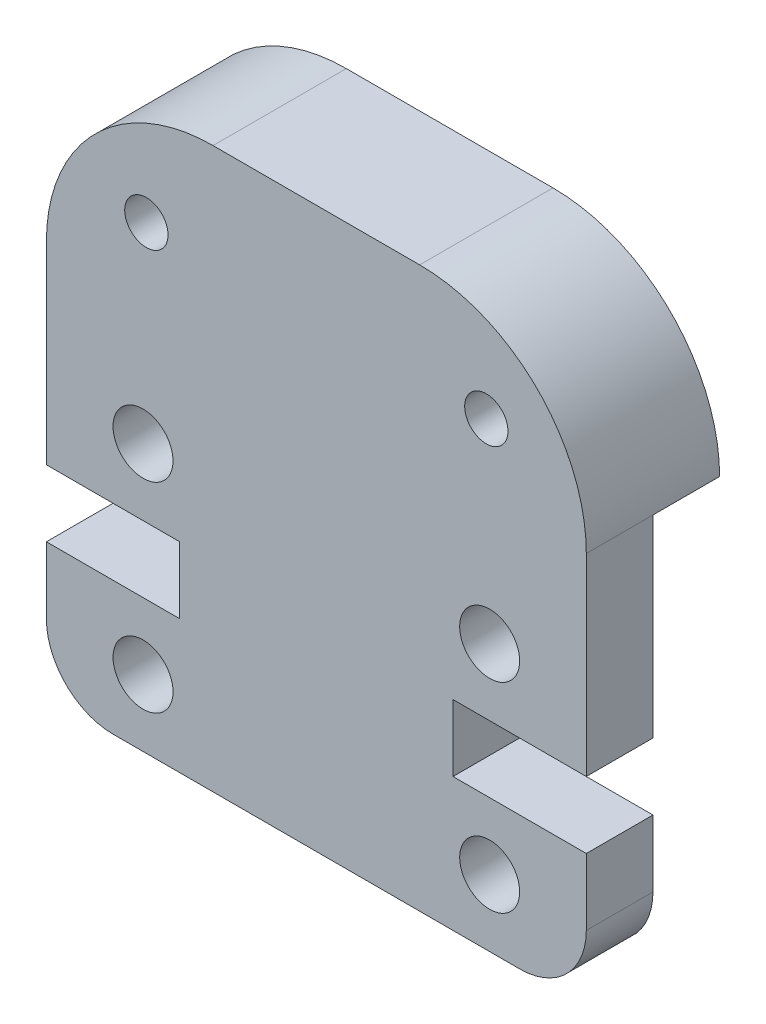
ISO-10303-21;
HEADER;
FILE_DESCRIPTION(('STEP AP214'),'2;1');
FILE_NAME('part.step','',(''),(''),'','','');
FILE_SCHEMA(('AUTOMOTIVE_DESIGN { 1 0 10303 214 1 1 1 1 }'));
ENDSEC;
DATA;
#1=APPLICATION_CONTEXT('core data for automotive mechanical design processes');
#2=APPLICATION_PROTOCOL_DEFINITION('international standard','automotive_design',2000,#1);
#3=PRODUCT_CONTEXT('',#1,'mechanical');
#4=PRODUCT('Part','Part','',(#3));
#5=PRODUCT_RELATED_PRODUCT_CATEGORY('part','',(#4));
#6=PRODUCT_DEFINITION_FORMATION('','',#4);
#7=PRODUCT_DEFINITION_CONTEXT('part definition',#1,'design');
#8=PRODUCT_DEFINITION('design','',#6,#7);
#9=PRODUCT_DEFINITION_SHAPE('','',#8);
#10=(LENGTH_UNIT() NAMED_UNIT(*) SI_UNIT(.MILLI.,.METRE.));
#11=(NAMED_UNIT(*) PLANE_ANGLE_UNIT() SI_UNIT($,.RADIAN.));
#12=(NAMED_UNIT(*) SI_UNIT($,.STERADIAN.) SOLID_ANGLE_UNIT());
#13=UNCERTAINTY_MEASURE_WITH_UNIT(LENGTH_MEASURE(1.E-05),#10,'distance_accuracy_value','');
#14=(GEOMETRIC_REPRESENTATION_CONTEXT(3) GLOBAL_UNCERTAINTY_ASSIGNED_CONTEXT((#13)) GLOBAL_UNIT_ASSIGNED_CONTEXT((#10,
#11,#12)) REPRESENTATION_CONTEXT('',''));
#15=CARTESIAN_POINT('',(0.,0.,0.));
#16=DIRECTION('',(0.,0.,1.));
#17=DIRECTION('',(1.,0.,0.));
#18=AXIS2_PLACEMENT_3D('',#15,#16,#17);
#19=CARTESIAN_POINT('',(5.,11.795,0.));
#20=DIRECTION('',(0.,0.,1.));
#21=DIRECTION('',(1.,0.,0.));
#22=AXIS2_PLACEMENT_3D('',#19,#20,#21);
#23=PLANE('',#22);
#24=CARTESIAN_POINT('',(13.1999999999957,13.7949999999999,0.));
#25=DIRECTION('',(0.,0.,1.));
#26=DIRECTION('',(-1.,0.,0.));
#27=AXIS2_PLACEMENT_3D('',#24,#25,#26);
#28=CIRCLE('',#27,0.649999999999999);
#29=CARTESIAN_POINT('',(12.5499999999957,13.7949999999999,0.));
#30=VERTEX_POINT('',#29);
#31=EDGE_CURVE('E262',#30,#30,#28,.T.);
#32=ORIENTED_EDGE('',*,*,#31,.T.);
#33=EDGE_LOOP('',(#32));
#34=FACE_BOUND('',#33,.T.);
#35=CARTESIAN_POINT('',(3.00000000000434,13.7949999999999,0.));
#36=DIRECTION('',(0.,0.,1.));
#37=DIRECTION('',(1.,0.,0.));
#38=AXIS2_PLACEMENT_3D('',#35,#36,#37);
#39=CIRCLE('',#38,0.65);
#40=CARTESIAN_POINT('',(3.65000000000434,13.7949999999999,0.));
#41=VERTEX_POINT('',#40);
#42=EDGE_CURVE('E266',#41,#41,#39,.T.);
#43=ORIENTED_EDGE('',*,*,#42,.T.);
#44=EDGE_LOOP('',(#43));
#45=FACE_BOUND('',#44,.T.);
#46=DIRECTION('',(-1.,0.,0.));
#47=VECTOR('',#46,1.);
#48=CARTESIAN_POINT('',(0.,11.795,0.));
#49=LINE('',#48,#47);
#50=CARTESIAN_POINT('',(16.2,11.795,0.));
#51=VERTEX_POINT('',#50);
#52=CARTESIAN_POINT('',(0.,11.795,0.));
#53=VERTEX_POINT('',#52);
#54=EDGE_CURVE('E220',#51,#53,#49,.T.);
#55=ORIENTED_EDGE('',*,*,#54,.T.);
#56=CARTESIAN_POINT('',(5.,11.795,0.));
#57=DIRECTION('',(0.,0.,1.));
#58=DIRECTION('',(1.,0.,0.));
#59=AXIS2_PLACEMENT_3D('',#56,#57,#58);
#60=CIRCLE('',#59,5.);
#61=CARTESIAN_POINT('',(5.,16.795,0.));
#62=VERTEX_POINT('',#61);
#63=EDGE_CURVE('E147',#62,#53,#60,.T.);
#64=ORIENTED_EDGE('',*,*,#63,.F.);
#65=DIRECTION('',(-1.,0.,0.));
#66=VECTOR('',#65,1.);
#67=CARTESIAN_POINT('',(5.,16.795,0.));
#68=LINE('',#67,#66);
#69=CARTESIAN_POINT('',(11.2,16.795,0.));
#70=VERTEX_POINT('',#69);
#71=EDGE_CURVE('E72',#70,#62,#68,.T.);
#72=ORIENTED_EDGE('',*,*,#71,.F.);
#73=CARTESIAN_POINT('',(11.2,11.795,0.));
#74=DIRECTION('',(0.,0.,1.));
#75=DIRECTION('',(-1.,0.,0.));
#76=AXIS2_PLACEMENT_3D('',#73,#74,#75);
#77=CIRCLE('',#76,5.);
#78=EDGE_CURVE('E66',#51,#70,#77,.T.);
#79=ORIENTED_EDGE('',*,*,#78,.F.);
#80=EDGE_LOOP('',(#55,#64,#72,#79));
#81=FACE_BOUND('',#80,.T.);
#82=ADVANCED_FACE('F33',(#34,#45,#81),#23,.F.);
#83=CARTESIAN_POINT('',(0.,6.00000000000001,4.));
#84=DIRECTION('',(1.,0.,0.));
#85=DIRECTION('',(0.,0.,-1.));
#86=AXIS2_PLACEMENT_3D('',#83,#84,#85);
#87=PLANE('',#86);
#88=DIRECTION('',(0.,-1.,0.));
#89=VECTOR('',#88,1.);
#90=CARTESIAN_POINT('',(0.,0.,2.));
#91=LINE('',#90,#89);
#92=CARTESIAN_POINT('',(0.,11.795,2.));
#93=VERTEX_POINT('',#92);
#94=CARTESIAN_POINT('',(0.,6.00000000000001,2.));
#95=VERTEX_POINT('',#94);
#96=EDGE_CURVE('E203',#93,#95,#91,.T.);
#97=ORIENTED_EDGE('',*,*,#96,.T.);
#98=DIRECTION('',(0.,0.,-1.));
#99=VECTOR('',#98,1.);
#100=CARTESIAN_POINT('',(0.,6.00000000000001,4.));
#101=LINE('',#100,#99);
#102=CARTESIAN_POINT('',(0.,6.00000000000001,4.));
#103=VERTEX_POINT('',#102);
#104=EDGE_CURVE('E43',#103,#95,#101,.T.);
#105=ORIENTED_EDGE('',*,*,#104,.F.);
#106=DIRECTION('',(0.,-1.,0.));
#107=VECTOR('',#106,1.);
#108=CARTESIAN_POINT('',(0.,6.00000000000001,4.));
#109=LINE('',#108,#107);
#110=CARTESIAN_POINT('',(0.,11.795,4.));
#111=VERTEX_POINT('',#110);
#112=EDGE_CURVE('E80',#111,#103,#109,.T.);
#113=ORIENTED_EDGE('',*,*,#112,.F.);
#114=DIRECTION('',(0.,0.,-1.));
#115=VECTOR('',#114,1.);
#116=CARTESIAN_POINT('',(0.,11.795,4.));
#117=LINE('',#116,#115);
#118=EDGE_CURVE('E11',#111,#93,#117,.T.);
#119=ORIENTED_EDGE('',*,*,#118,.T.);
#120=EDGE_LOOP('',(#97,#105,#113,#119));
#121=FACE_BOUND('',#120,.T.);
#122=ADVANCED_FACE('F201',(#121),#87,.F.);
#123=CARTESIAN_POINT('',(0.,6.00000000000001,4.));
#124=DIRECTION('',(0.,1.,0.));
#125=DIRECTION('',(0.,0.,1.));
#126=AXIS2_PLACEMENT_3D('',#123,#124,#125);
#127=PLANE('',#126);
#128=DIRECTION('',(-1.,0.,0.));
#129=VECTOR('',#128,1.);
#130=CARTESIAN_POINT('',(0.,6.00000000000001,2.));
#131=LINE('',#130,#129);
#132=CARTESIAN_POINT('',(4.,6.00000000000001,2.));
#133=VERTEX_POINT('',#132);
#134=EDGE_CURVE('E195',#133,#95,#131,.T.);
#135=ORIENTED_EDGE('',*,*,#134,.F.);
#136=DIRECTION('',(0.,0.,-1.));
#137=VECTOR('',#136,1.);
#138=CARTESIAN_POINT('',(4.,6.00000000000001,4.));
#139=LINE('',#138,#137);
#140=CARTESIAN_POINT('',(4.,6.00000000000001,4.));
#141=VERTEX_POINT('',#140);
#142=EDGE_CURVE('E184',#141,#133,#139,.T.);
#143=ORIENTED_EDGE('',*,*,#142,.F.);
#144=DIRECTION('',(1.,0.,0.));
#145=VECTOR('',#144,1.);
#146=CARTESIAN_POINT('',(0.,6.00000000000001,4.));
#147=LINE('',#146,#145);
#148=EDGE_CURVE('E196',#103,#141,#147,.T.);
#149=ORIENTED_EDGE('',*,*,#148,.F.);
#150=ORIENTED_EDGE('',*,*,#104,.T.);
#151=EDGE_LOOP('',(#135,#143,#149,#150));
#152=FACE_BOUND('',#151,.T.);
#153=ADVANCED_FACE('F192',(#152),#127,.F.);
#154=CARTESIAN_POINT('',(4.,6.00000000000001,4.));
#155=DIRECTION('',(1.,0.,0.));
#156=DIRECTION('',(0.,0.,-1.));
#157=AXIS2_PLACEMENT_3D('',#154,#155,#156);
#158=PLANE('',#157);
#159=DIRECTION('',(0.,1.,0.));
#160=VECTOR('',#159,1.);
#161=CARTESIAN_POINT('',(4.,6.00000000000001,2.));
#162=LINE('',#161,#160);
#163=CARTESIAN_POINT('',(4.,4.,2.));
#164=VERTEX_POINT('',#163);
#165=EDGE_CURVE('E252',#164,#133,#162,.T.);
#166=ORIENTED_EDGE('',*,*,#165,.F.);
#167=DIRECTION('',(0.,0.,-1.));
#168=VECTOR('',#167,1.);
#169=CARTESIAN_POINT('',(4.,4.,4.));
#170=LINE('',#169,#168);
#171=CARTESIAN_POINT('',(4.,4.,4.));
#172=VERTEX_POINT('',#171);
#173=EDGE_CURVE('E181',#172,#164,#170,.T.);
#174=ORIENTED_EDGE('',*,*,#173,.F.);
#175=DIRECTION('',(0.,-1.,0.));
#176=VECTOR('',#175,1.);
#177=CARTESIAN_POINT('',(4.,6.00000000000001,4.));
#178=LINE('',#177,#176);
#179=EDGE_CURVE('E282',#141,#172,#178,.T.);
#180=ORIENTED_EDGE('',*,*,#179,.F.);
#181=ORIENTED_EDGE('',*,*,#142,.T.);
#182=EDGE_LOOP('',(#166,#174,#180,#181));
#183=FACE_BOUND('',#182,.T.);
#184=ADVANCED_FACE('F328',(#183),#158,.F.);
#185=CARTESIAN_POINT('',(4.,4.,4.));
#186=DIRECTION('',(0.,-1.,0.));
#187=DIRECTION('',(0.,0.,-1.));
#188=AXIS2_PLACEMENT_3D('',#185,#186,#187);
#189=PLANE('',#188);
#190=DIRECTION('',(1.,0.,0.));
#191=VECTOR('',#190,1.);
#192=CARTESIAN_POINT('',(4.,4.,2.));
#193=LINE('',#192,#191);
#194=CARTESIAN_POINT('',(0.,4.,2.));
#195=VERTEX_POINT('',#194);
#196=EDGE_CURVE('E249',#195,#164,#193,.T.);
#197=ORIENTED_EDGE('',*,*,#196,.F.);
#198=DIRECTION('',(0.,0.,-1.));
#199=VECTOR('',#198,1.);
#200=CARTESIAN_POINT('',(0.,4.,4.));
#201=LINE('',#200,#199);
#202=CARTESIAN_POINT('',(0.,4.,4.));
#203=VERTEX_POINT('',#202);
#204=EDGE_CURVE('E178',#203,#195,#201,.T.);
#205=ORIENTED_EDGE('',*,*,#204,.F.);
#206=DIRECTION('',(-1.,0.,0.));
#207=VECTOR('',#206,1.);
#208=CARTESIAN_POINT('',(4.,4.,4.));
#209=LINE('',#208,#207);
#210=EDGE_CURVE('E284',#172,#203,#209,.T.);
#211=ORIENTED_EDGE('',*,*,#210,.F.);
#212=ORIENTED_EDGE('',*,*,#173,.T.);
#213=EDGE_LOOP('',(#197,#205,#211,#212));
#214=FACE_BOUND('',#213,.T.);
#215=ADVANCED_FACE('F332',(#214),#189,.F.);
#216=CARTESIAN_POINT('',(0.,2.,4.));
#217=DIRECTION('',(1.,0.,0.));
#218=DIRECTION('',(0.,0.,-1.));
#219=AXIS2_PLACEMENT_3D('',#216,#217,#218);
#220=PLANE('',#219);
#221=CARTESIAN_POINT('',(0.,2.,2.));
#222=VERTEX_POINT('',#221);
#223=EDGE_CURVE('E210',#195,#222,#91,.T.);
#224=ORIENTED_EDGE('',*,*,#223,.T.);
#225=DIRECTION('',(0.,0.,-1.));
#226=VECTOR('',#225,1.);
#227=CARTESIAN_POINT('',(0.,2.,4.));
#228=LINE('',#227,#226);
#229=CARTESIAN_POINT('',(0.,2.,4.));
#230=VERTEX_POINT('',#229);
#231=EDGE_CURVE('E175',#230,#222,#228,.T.);
#232=ORIENTED_EDGE('',*,*,#231,.F.);
#233=DIRECTION('',(0.,-1.,0.));
#234=VECTOR('',#233,1.);
#235=CARTESIAN_POINT('',(0.,2.,4.));
#236=LINE('',#235,#234);
#237=EDGE_CURVE('E286',#203,#230,#236,.T.);
#238=ORIENTED_EDGE('',*,*,#237,.F.);
#239=ORIENTED_EDGE('',*,*,#204,.T.);
#240=EDGE_LOOP('',(#224,#232,#238,#239));
#241=FACE_BOUND('',#240,.T.);
#242=ADVANCED_FACE('F390',(#241),#220,.F.);
#243=CARTESIAN_POINT('',(2.,2.,4.));
#244=DIRECTION('',(0.,0.,-1.));
#245=DIRECTION('',(-1.,0.,0.));
#246=AXIS2_PLACEMENT_3D('',#243,#244,#245);
#247=CYLINDRICAL_SURFACE('',#246,2.);
#248=CARTESIAN_POINT('',(2.,2.,2.));
#249=DIRECTION('',(0.,0.,-1.));
#250=DIRECTION('',(-1.,0.,0.));
#251=AXIS2_PLACEMENT_3D('',#248,#249,#250);
#252=CIRCLE('',#251,2.);
#253=CARTESIAN_POINT('',(2.,0.,2.));
#254=VERTEX_POINT('',#253);
#255=EDGE_CURVE('E246',#254,#222,#252,.T.);
#256=ORIENTED_EDGE('',*,*,#255,.F.);
#257=DIRECTION('',(0.,0.,-1.));
#258=VECTOR('',#257,1.);
#259=CARTESIAN_POINT('',(2.,0.,4.));
#260=LINE('',#259,#258);
#261=CARTESIAN_POINT('',(2.,0.,4.));
#262=VERTEX_POINT('',#261);
#263=EDGE_CURVE('E172',#262,#254,#260,.T.);
#264=ORIENTED_EDGE('',*,*,#263,.F.);
#265=CARTESIAN_POINT('',(2.,2.,4.));
#266=DIRECTION('',(0.,0.,1.));
#267=DIRECTION('',(1.,0.,0.));
#268=AXIS2_PLACEMENT_3D('',#265,#266,#267);
#269=CIRCLE('',#268,2.);
#270=EDGE_CURVE('E288',#230,#262,#269,.T.);
#271=ORIENTED_EDGE('',*,*,#270,.F.);
#272=ORIENTED_EDGE('',*,*,#231,.T.);
#273=EDGE_LOOP('',(#256,#264,#271,#272));
#274=FACE_BOUND('',#273,.T.);
#275=ADVANCED_FACE('F386',(#274),#247,.T.);
#276=CARTESIAN_POINT('',(2.,0.,4.));
#277=DIRECTION('',(0.,1.,0.));
#278=DIRECTION('',(-1.,0.,0.));
#279=AXIS2_PLACEMENT_3D('',#276,#277,#278);
#280=PLANE('',#279);
#281=DIRECTION('',(1.,0.,0.));
#282=VECTOR('',#281,1.);
#283=CARTESIAN_POINT('',(16.2,0.,2.));
#284=LINE('',#283,#282);
#285=CARTESIAN_POINT('',(14.2,0.,2.));
#286=VERTEX_POINT('',#285);
#287=EDGE_CURVE('E222',#254,#286,#284,.T.);
#288=ORIENTED_EDGE('',*,*,#287,.T.);
#289=DIRECTION('',(0.,0.,-1.));
#290=VECTOR('',#289,1.);
#291=CARTESIAN_POINT('',(14.2,0.,4.));
#292=LINE('',#291,#290);
#293=CARTESIAN_POINT('',(14.2,0.,4.));
#294=VERTEX_POINT('',#293);
#295=EDGE_CURVE('E169',#294,#286,#292,.T.);
#296=ORIENTED_EDGE('',*,*,#295,.F.);
#297=DIRECTION('',(1.,0.,0.));
#298=VECTOR('',#297,1.);
#299=CARTESIAN_POINT('',(2.,0.,4.));
#300=LINE('',#299,#298);
#301=EDGE_CURVE('E290',#262,#294,#300,.T.);
#302=ORIENTED_EDGE('',*,*,#301,.F.);
#303=ORIENTED_EDGE('',*,*,#263,.T.);
#304=EDGE_LOOP('',(#288,#296,#302,#303));
#305=FACE_BOUND('',#304,.T.);
#306=ADVANCED_FACE('F382',(#305),#280,.F.);
#307=CARTESIAN_POINT('',(14.2,2.,4.));
#308=DIRECTION('',(0.,0.,-1.));
#309=DIRECTION('',(-1.,0.,0.));
#310=AXIS2_PLACEMENT_3D('',#307,#308,#309);
#311=CYLINDRICAL_SURFACE('',#310,2.);
#312=CARTESIAN_POINT('',(14.2,2.,2.));
#313=DIRECTION('',(0.,0.,-1.));
#314=DIRECTION('',(-1.,0.,0.));
#315=AXIS2_PLACEMENT_3D('',#312,#313,#314);
#316=CIRCLE('',#315,2.);
#317=CARTESIAN_POINT('',(16.2,2.,2.));
#318=VERTEX_POINT('',#317);
#319=EDGE_CURVE('E243',#318,#286,#316,.T.);
#320=ORIENTED_EDGE('',*,*,#319,.F.);
#321=DIRECTION('',(0.,0.,-1.));
#322=VECTOR('',#321,1.);
#323=CARTESIAN_POINT('',(16.2,2.,4.));
#324=LINE('',#323,#322);
#325=CARTESIAN_POINT('',(16.2,2.,4.));
#326=VERTEX_POINT('',#325);
#327=EDGE_CURVE('E166',#326,#318,#324,.T.);
#328=ORIENTED_EDGE('',*,*,#327,.F.);
#329=CARTESIAN_POINT('',(14.2,2.,4.));
#330=DIRECTION('',(0.,0.,1.));
#331=DIRECTION('',(-1.,0.,0.));
#332=AXIS2_PLACEMENT_3D('',#329,#330,#331);
#333=CIRCLE('',#332,2.);
#334=EDGE_CURVE('E292',#294,#326,#333,.T.);
#335=ORIENTED_EDGE('',*,*,#334,.F.);
#336=ORIENTED_EDGE('',*,*,#295,.T.);
#337=EDGE_LOOP('',(#320,#328,#335,#336));
#338=FACE_BOUND('',#337,.T.);
#339=ADVANCED_FACE('F378',(#338),#311,.T.);
#340=CARTESIAN_POINT('',(16.2,2.,4.));
#341=DIRECTION('',(-1.,0.,0.));
#342=DIRECTION('',(0.,0.,1.));
#343=AXIS2_PLACEMENT_3D('',#340,#341,#342);
#344=PLANE('',#343);
#345=DIRECTION('',(0.,1.,0.));
#346=VECTOR('',#345,1.);
#347=CARTESIAN_POINT('',(16.2,11.795,2.));
#348=LINE('',#347,#346);
#349=CARTESIAN_POINT('',(16.2,4.,2.));
#350=VERTEX_POINT('',#349);
#351=EDGE_CURVE('E624',#318,#350,#348,.T.);
#352=ORIENTED_EDGE('',*,*,#351,.T.);
#353=DIRECTION('',(0.,0.,-1.));
#354=VECTOR('',#353,1.);
#355=CARTESIAN_POINT('',(16.2,4.,4.));
#356=LINE('',#355,#354);
#357=CARTESIAN_POINT('',(16.2,4.,4.));
#358=VERTEX_POINT('',#357);
#359=EDGE_CURVE('E163',#358,#350,#356,.T.);
#360=ORIENTED_EDGE('',*,*,#359,.F.);
#361=DIRECTION('',(0.,1.,0.));
#362=VECTOR('',#361,1.);
#363=CARTESIAN_POINT('',(16.2,2.,4.));
#364=LINE('',#363,#362);
#365=EDGE_CURVE('E294',#326,#358,#364,.T.);
#366=ORIENTED_EDGE('',*,*,#365,.F.);
#367=ORIENTED_EDGE('',*,*,#327,.T.);
#368=EDGE_LOOP('',(#352,#360,#366,#367));
#369=FACE_BOUND('',#368,.T.);
#370=ADVANCED_FACE('F374',(#369),#344,.F.);
#371=CARTESIAN_POINT('',(12.2,4.,4.));
#372=DIRECTION('',(0.,-1.,0.));
#373=DIRECTION('',(1.,0.,0.));
#374=AXIS2_PLACEMENT_3D('',#371,#372,#373);
#375=PLANE('',#374);
#376=DIRECTION('',(1.,0.,0.));
#377=VECTOR('',#376,1.);
#378=CARTESIAN_POINT('',(12.2,4.,2.));
#379=LINE('',#378,#377);
#380=CARTESIAN_POINT('',(12.2,4.,2.));
#381=VERTEX_POINT('',#380);
#382=EDGE_CURVE('E240',#381,#350,#379,.T.);
#383=ORIENTED_EDGE('',*,*,#382,.F.);
#384=DIRECTION('',(0.,0.,-1.));
#385=VECTOR('',#384,1.);
#386=CARTESIAN_POINT('',(12.2,4.,4.));
#387=LINE('',#386,#385);
#388=CARTESIAN_POINT('',(12.2,4.,4.));
#389=VERTEX_POINT('',#388);
#390=EDGE_CURVE('E160',#389,#381,#387,.T.);
#391=ORIENTED_EDGE('',*,*,#390,.F.);
#392=DIRECTION('',(-1.,0.,0.));
#393=VECTOR('',#392,1.);
#394=CARTESIAN_POINT('',(12.2,4.,4.));
#395=LINE('',#394,#393);
#396=EDGE_CURVE('E296',#358,#389,#395,.T.);
#397=ORIENTED_EDGE('',*,*,#396,.F.);
#398=ORIENTED_EDGE('',*,*,#359,.T.);
#399=EDGE_LOOP('',(#383,#391,#397,#398));
#400=FACE_BOUND('',#399,.T.);
#401=ADVANCED_FACE('F371',(#400),#375,.F.);
#402=CARTESIAN_POINT('',(12.2,6.,4.));
#403=DIRECTION('',(-1.,0.,0.));
#404=DIRECTION('',(0.,0.,1.));
#405=AXIS2_PLACEMENT_3D('',#402,#403,#404);
#406=PLANE('',#405);
#407=DIRECTION('',(0.,-1.,0.));
#408=VECTOR('',#407,1.);
#409=CARTESIAN_POINT('',(12.2,6.,2.));
#410=LINE('',#409,#408);
#411=CARTESIAN_POINT('',(12.2,6.,2.));
#412=VERTEX_POINT('',#411);
#413=EDGE_CURVE('E237',#412,#381,#410,.T.);
#414=ORIENTED_EDGE('',*,*,#413,.F.);
#415=DIRECTION('',(0.,0.,-1.));
#416=VECTOR('',#415,1.);
#417=CARTESIAN_POINT('',(12.2,6.,4.));
#418=LINE('',#417,#416);
#419=CARTESIAN_POINT('',(12.2,6.,4.));
#420=VERTEX_POINT('',#419);
#421=EDGE_CURVE('E157',#420,#412,#418,.T.);
#422=ORIENTED_EDGE('',*,*,#421,.F.);
#423=DIRECTION('',(0.,1.,0.));
#424=VECTOR('',#423,1.);
#425=CARTESIAN_POINT('',(12.2,6.,4.));
#426=LINE('',#425,#424);
#427=EDGE_CURVE('E298',#389,#420,#426,.T.);
#428=ORIENTED_EDGE('',*,*,#427,.F.);
#429=ORIENTED_EDGE('',*,*,#390,.T.);
#430=EDGE_LOOP('',(#414,#422,#428,#429));
#431=FACE_BOUND('',#430,.T.);
#432=ADVANCED_FACE('F305',(#431),#406,.F.);
#433=CARTESIAN_POINT('',(16.2,6.00000000000001,4.));
#434=DIRECTION('',(0.,1.,0.));
#435=DIRECTION('',(-1.,0.,0.));
#436=AXIS2_PLACEMENT_3D('',#433,#434,#435);
#437=PLANE('',#436);
#438=DIRECTION('',(-1.,0.,0.));
#439=VECTOR('',#438,1.);
#440=CARTESIAN_POINT('',(16.2,6.00000000000001,2.));
#441=LINE('',#440,#439);
#442=CARTESIAN_POINT('',(16.2,6.00000000000001,2.));
#443=VERTEX_POINT('',#442);
#444=EDGE_CURVE('E234',#443,#412,#441,.T.);
#445=ORIENTED_EDGE('',*,*,#444,.F.);
#446=DIRECTION('',(0.,0.,-1.));
#447=VECTOR('',#446,1.);
#448=CARTESIAN_POINT('',(16.2,6.00000000000001,4.));
#449=LINE('',#448,#447);
#450=CARTESIAN_POINT('',(16.2,6.00000000000001,4.));
#451=VERTEX_POINT('',#450);
#452=EDGE_CURVE('E138',#451,#443,#449,.T.);
#453=ORIENTED_EDGE('',*,*,#452,.F.);
#454=DIRECTION('',(1.,0.,0.));
#455=VECTOR('',#454,1.);
#456=CARTESIAN_POINT('',(16.2,6.00000000000001,4.));
#457=LINE('',#456,#455);
#458=EDGE_CURVE('E126',#420,#451,#457,.T.);
#459=ORIENTED_EDGE('',*,*,#458,.F.);
#460=ORIENTED_EDGE('',*,*,#421,.T.);
#461=EDGE_LOOP('',(#445,#453,#459,#460));
#462=FACE_BOUND('',#461,.T.);
#463=ADVANCED_FACE('F309',(#462),#437,.F.);
#464=CARTESIAN_POINT('',(16.2,6.00000000000001,4.));
#465=DIRECTION('',(-1.,0.,0.));
#466=DIRECTION('',(0.,-1.,0.));
#467=AXIS2_PLACEMENT_3D('',#464,#465,#466);
#468=PLANE('',#467);
#469=CARTESIAN_POINT('',(16.2,11.795,2.));
#470=VERTEX_POINT('',#469);
#471=EDGE_CURVE('E137',#443,#470,#348,.T.);
#472=ORIENTED_EDGE('',*,*,#471,.T.);
#473=DIRECTION('',(0.,0.,-1.));
#474=VECTOR('',#473,1.);
#475=CARTESIAN_POINT('',(16.2,11.795,4.));
#476=LINE('',#475,#474);
#477=CARTESIAN_POINT('',(16.2,11.795,4.));
#478=VERTEX_POINT('',#477);
#479=EDGE_CURVE('E133',#478,#470,#476,.T.);
#480=ORIENTED_EDGE('',*,*,#479,.F.);
#481=DIRECTION('',(0.,1.,0.));
#482=VECTOR('',#481,1.);
#483=CARTESIAN_POINT('',(16.2,6.00000000000001,4.));
#484=LINE('',#483,#482);
#485=EDGE_CURVE('E119',#451,#478,#484,.T.);
#486=ORIENTED_EDGE('',*,*,#485,.F.);
#487=ORIENTED_EDGE('',*,*,#452,.T.);
#488=EDGE_LOOP('',(#472,#480,#486,#487));
#489=FACE_BOUND('',#488,.T.);
#490=ADVANCED_FACE('F134',(#489),#468,.F.);
#491=CARTESIAN_POINT('',(13.3,2.,4.));
#492=DIRECTION('',(0.,0.,-1.));
#493=DIRECTION('',(-1.,0.,0.));
#494=AXIS2_PLACEMENT_3D('',#491,#492,#493);
#495=CYLINDRICAL_SURFACE('',#494,0.9);
#496=CARTESIAN_POINT('',(13.3,2.,4.));
#497=DIRECTION('',(0.,0.,1.));
#498=DIRECTION('',(-1.,0.,0.));
#499=AXIS2_PLACEMENT_3D('',#496,#497,#498);
#500=CIRCLE('',#499,0.9);
#501=CARTESIAN_POINT('',(12.4,2.,4.));
#502=VERTEX_POINT('',#501);
#503=EDGE_CURVE('E150',#502,#502,#500,.T.);
#504=ORIENTED_EDGE('',*,*,#503,.T.);
#505=EDGE_LOOP('',(#504));
#506=FACE_BOUND('',#505,.T.);
#507=CARTESIAN_POINT('',(13.3,2.,2.));
#508=DIRECTION('',(0.,0.,-1.));
#509=DIRECTION('',(-1.,0.,0.));
#510=AXIS2_PLACEMENT_3D('',#507,#508,#509);
#511=CIRCLE('',#510,0.9);
#512=CARTESIAN_POINT('',(12.4,2.,2.));
#513=VERTEX_POINT('',#512);
#514=EDGE_CURVE('E231',#513,#513,#511,.T.);
#515=ORIENTED_EDGE('',*,*,#514,.T.);
#516=EDGE_LOOP('',(#515));
#517=FACE_BOUND('',#516,.T.);
#518=ADVANCED_FACE('F366',(#506,#517),#495,.F.);
#519=CARTESIAN_POINT('',(13.3,7.99999999999954,4.));
#520=DIRECTION('',(0.,0.,-1.));
#521=DIRECTION('',(-1.,0.,0.));
#522=AXIS2_PLACEMENT_3D('',#519,#520,#521);
#523=CYLINDRICAL_SURFACE('',#522,0.9);
#524=CARTESIAN_POINT('',(13.3,7.99999999999954,4.));
#525=DIRECTION('',(0.,0.,1.));
#526=DIRECTION('',(1.,0.,0.));
#527=AXIS2_PLACEMENT_3D('',#524,#525,#526);
#528=CIRCLE('',#527,0.9);
#529=CARTESIAN_POINT('',(14.2,7.99999999999954,4.));
#530=VERTEX_POINT('',#529);
#531=EDGE_CURVE('E272',#530,#530,#528,.T.);
#532=ORIENTED_EDGE('',*,*,#531,.T.);
#533=EDGE_LOOP('',(#532));
#534=FACE_BOUND('',#533,.T.);
#535=CARTESIAN_POINT('',(13.3,7.99999999999954,2.));
#536=DIRECTION('',(0.,0.,-1.));
#537=DIRECTION('',(-1.,0.,0.));
#538=AXIS2_PLACEMENT_3D('',#535,#536,#537);
#539=CIRCLE('',#538,0.9);
#540=CARTESIAN_POINT('',(12.4,7.99999999999954,2.));
#541=VERTEX_POINT('',#540);
#542=EDGE_CURVE('E228',#541,#541,#539,.T.);
#543=ORIENTED_EDGE('',*,*,#542,.T.);
#544=EDGE_LOOP('',(#543));
#545=FACE_BOUND('',#544,.T.);
#546=ADVANCED_FACE('F454',(#534,#545),#523,.F.);
#547=CARTESIAN_POINT('',(2.9,2.,4.));
#548=DIRECTION('',(0.,0.,-1.));
#549=DIRECTION('',(-1.,0.,0.));
#550=AXIS2_PLACEMENT_3D('',#547,#548,#549);
#551=CYLINDRICAL_SURFACE('',#550,0.9);
#552=CARTESIAN_POINT('',(2.9,2.,4.));
#553=DIRECTION('',(0.,0.,1.));
#554=DIRECTION('',(1.,0.,0.));
#555=AXIS2_PLACEMENT_3D('',#552,#553,#554);
#556=CIRCLE('',#555,0.9);
#557=CARTESIAN_POINT('',(3.8,2.,4.));
#558=VERTEX_POINT('',#557);
#559=EDGE_CURVE('E259',#558,#558,#556,.T.);
#560=ORIENTED_EDGE('',*,*,#559,.T.);
#561=EDGE_LOOP('',(#560));
#562=FACE_BOUND('',#561,.T.);
#563=CARTESIAN_POINT('',(2.9,2.,2.));
#564=DIRECTION('',(0.,0.,-1.));
#565=DIRECTION('',(-1.,0.,0.));
#566=AXIS2_PLACEMENT_3D('',#563,#564,#565);
#567=CIRCLE('',#566,0.9);
#568=CARTESIAN_POINT('',(2.,2.,2.));
#569=VERTEX_POINT('',#568);
#570=EDGE_CURVE('E225',#569,#569,#567,.T.);
#571=ORIENTED_EDGE('',*,*,#570,.T.);
#572=EDGE_LOOP('',(#571));
#573=FACE_BOUND('',#572,.T.);
#574=ADVANCED_FACE('F461',(#562,#573),#551,.F.);
#575=CARTESIAN_POINT('',(2.9,7.99999999999954,4.));
#576=DIRECTION('',(0.,0.,-1.));
#577=DIRECTION('',(-1.,0.,0.));
#578=AXIS2_PLACEMENT_3D('',#575,#576,#577);
#579=CYLINDRICAL_SURFACE('',#578,0.9);
#580=CARTESIAN_POINT('',(2.9,7.99999999999954,4.));
#581=DIRECTION('',(0.,0.,1.));
#582=DIRECTION('',(-1.,0.,0.));
#583=AXIS2_PLACEMENT_3D('',#580,#581,#582);
#584=CIRCLE('',#583,0.9);
#585=CARTESIAN_POINT('',(2.,7.99999999999954,4.));
#586=VERTEX_POINT('',#585);
#587=EDGE_CURVE('E256',#586,#586,#584,.T.);
#588=ORIENTED_EDGE('',*,*,#587,.T.);
#589=EDGE_LOOP('',(#588));
#590=FACE_BOUND('',#589,.T.);
#591=CARTESIAN_POINT('',(2.9,7.99999999999954,2.));
#592=DIRECTION('',(0.,0.,-1.));
#593=DIRECTION('',(-1.,0.,0.));
#594=AXIS2_PLACEMENT_3D('',#591,#592,#593);
#595=CIRCLE('',#594,0.9);
#596=CARTESIAN_POINT('',(2.,7.99999999999954,2.));
#597=VERTEX_POINT('',#596);
#598=EDGE_CURVE('E37',#597,#597,#595,.T.);
#599=ORIENTED_EDGE('',*,*,#598,.T.);
#600=EDGE_LOOP('',(#599));
#601=FACE_BOUND('',#600,.T.);
#602=ADVANCED_FACE('F469',(#590,#601),#579,.F.);
#603=CARTESIAN_POINT('',(5.,11.795,4.));
#604=DIRECTION('',(0.,0.,1.));
#605=DIRECTION('',(1.,0.,0.));
#606=AXIS2_PLACEMENT_3D('',#603,#604,#605);
#607=PLANE('',#606);
#608=ORIENTED_EDGE('',*,*,#559,.F.);
#609=EDGE_LOOP('',(#608));
#610=FACE_BOUND('',#609,.T.);
#611=CARTESIAN_POINT('',(3.00000000000434,13.7949999999999,4.));
#612=DIRECTION('',(0.,0.,1.));
#613=DIRECTION('',(1.,0.,0.));
#614=AXIS2_PLACEMENT_3D('',#611,#612,#613);
#615=CIRCLE('',#614,0.65);
#616=CARTESIAN_POINT('',(3.65000000000434,13.7949999999999,4.));
#617=VERTEX_POINT('',#616);
#618=EDGE_CURVE('E269',#617,#617,#615,.T.);
#619=ORIENTED_EDGE('',*,*,#618,.F.);
#620=EDGE_LOOP('',(#619));
#621=FACE_BOUND('',#620,.T.);
#622=ORIENTED_EDGE('',*,*,#503,.F.);
#623=EDGE_LOOP('',(#622));
#624=FACE_BOUND('',#623,.T.);
#625=CARTESIAN_POINT('',(5.,11.795,4.));
#626=DIRECTION('',(0.,0.,1.));
#627=DIRECTION('',(1.,0.,0.));
#628=AXIS2_PLACEMENT_3D('',#625,#626,#627);
#629=CIRCLE('',#628,5.);
#630=CARTESIAN_POINT('',(5.,16.795,4.));
#631=VERTEX_POINT('',#630);
#632=EDGE_CURVE('E153',#631,#111,#629,.T.);
#633=ORIENTED_EDGE('',*,*,#632,.T.);
#634=ORIENTED_EDGE('',*,*,#112,.T.);
#635=ORIENTED_EDGE('',*,*,#148,.T.);
#636=ORIENTED_EDGE('',*,*,#179,.T.);
#637=ORIENTED_EDGE('',*,*,#210,.T.);
#638=ORIENTED_EDGE('',*,*,#237,.T.);
#639=ORIENTED_EDGE('',*,*,#270,.T.);
#640=ORIENTED_EDGE('',*,*,#301,.T.);
#641=ORIENTED_EDGE('',*,*,#334,.T.);
#642=ORIENTED_EDGE('',*,*,#365,.T.);
#643=ORIENTED_EDGE('',*,*,#396,.T.);
#644=ORIENTED_EDGE('',*,*,#427,.T.);
#645=ORIENTED_EDGE('',*,*,#458,.T.);
#646=ORIENTED_EDGE('',*,*,#485,.T.);
#647=CARTESIAN_POINT('',(11.2,11.795,4.));
#648=DIRECTION('',(0.,0.,1.));
#649=DIRECTION('',(-1.,0.,0.));
#650=AXIS2_PLACEMENT_3D('',#647,#648,#649);
#651=CIRCLE('',#650,5.);
#652=CARTESIAN_POINT('',(11.2,16.795,4.));
#653=VERTEX_POINT('',#652);
#654=EDGE_CURVE('E124',#478,#653,#651,.T.);
#655=ORIENTED_EDGE('',*,*,#654,.T.);
#656=DIRECTION('',(-1.,0.,0.));
#657=VECTOR('',#656,1.);
#658=CARTESIAN_POINT('',(5.,16.795,4.));
#659=LINE('',#658,#657);
#660=EDGE_CURVE('E51',#653,#631,#659,.T.);
#661=ORIENTED_EDGE('',*,*,#660,.T.);
#662=EDGE_LOOP('',(#633,#634,#635,#636,#637,#638,#639,#640,#641,#642,#643,#644,#645,#646,#655,#661));
#663=FACE_BOUND('',#662,.T.);
#664=ORIENTED_EDGE('',*,*,#531,.F.);
#665=EDGE_LOOP('',(#664));
#666=FACE_BOUND('',#665,.T.);
#667=CARTESIAN_POINT('',(13.1999999999957,13.7949999999999,4.));
#668=DIRECTION('',(0.,0.,1.));
#669=DIRECTION('',(-1.,0.,0.));
#670=AXIS2_PLACEMENT_3D('',#667,#668,#669);
#671=CIRCLE('',#670,0.649999999999999);
#672=CARTESIAN_POINT('',(12.5499999999957,13.7949999999999,4.));
#673=VERTEX_POINT('',#672);
#674=EDGE_CURVE('E263',#673,#673,#671,.T.);
#675=ORIENTED_EDGE('',*,*,#674,.F.);
#676=EDGE_LOOP('',(#675));
#677=FACE_BOUND('',#676,.T.);
#678=ORIENTED_EDGE('',*,*,#587,.F.);
#679=EDGE_LOOP('',(#678));
#680=FACE_BOUND('',#679,.T.);
#681=ADVANCED_FACE('F121',(#610,#621,#624,#663,#666,#677,#680),#607,.T.);
#682=CARTESIAN_POINT('',(5.,11.795,4.));
#683=DIRECTION('',(0.,0.,-1.));
#684=DIRECTION('',(-1.,0.,0.));
#685=AXIS2_PLACEMENT_3D('',#682,#683,#684);
#686=CYLINDRICAL_SURFACE('',#685,5.);
#687=ORIENTED_EDGE('',*,*,#63,.T.);
#688=DIRECTION('',(0.,0.,-1.));
#689=VECTOR('',#688,1.);
#690=CARTESIAN_POINT('',(0.,11.795,2.));
#691=LINE('',#690,#689);
#692=EDGE_CURVE('E209',#93,#53,#691,.T.);
#693=ORIENTED_EDGE('',*,*,#692,.F.);
#694=ORIENTED_EDGE('',*,*,#118,.F.);
#695=ORIENTED_EDGE('',*,*,#632,.F.);
#696=DIRECTION('',(0.,0.,-1.));
#697=VECTOR('',#696,1.);
#698=CARTESIAN_POINT('',(5.,16.795,4.));
#699=LINE('',#698,#697);
#700=EDGE_CURVE('E143',#631,#62,#699,.T.);
#701=ORIENTED_EDGE('',*,*,#700,.T.);
#702=EDGE_LOOP('',(#687,#693,#694,#695,#701));
#703=FACE_BOUND('',#702,.T.);
#704=ADVANCED_FACE('F35',(#703),#686,.T.);
#705=CARTESIAN_POINT('',(11.2,11.795,4.));
#706=DIRECTION('',(0.,0.,-1.));
#707=DIRECTION('',(-1.,0.,0.));
#708=AXIS2_PLACEMENT_3D('',#705,#706,#707);
#709=CYLINDRICAL_SURFACE('',#708,5.);
#710=ORIENTED_EDGE('',*,*,#78,.T.);
#711=DIRECTION('',(0.,0.,-1.));
#712=VECTOR('',#711,1.);
#713=CARTESIAN_POINT('',(11.2,16.795,4.));
#714=LINE('',#713,#712);
#715=EDGE_CURVE('E139',#653,#70,#714,.T.);
#716=ORIENTED_EDGE('',*,*,#715,.F.);
#717=ORIENTED_EDGE('',*,*,#654,.F.);
#718=ORIENTED_EDGE('',*,*,#479,.T.);
#719=DIRECTION('',(0.,0.,-1.));
#720=VECTOR('',#719,1.);
#721=CARTESIAN_POINT('',(16.2,11.795,2.));
#722=LINE('',#721,#720);
#723=EDGE_CURVE('E213',#470,#51,#722,.T.);
#724=ORIENTED_EDGE('',*,*,#723,.T.);
#725=EDGE_LOOP('',(#710,#716,#717,#718,#724));
#726=FACE_BOUND('',#725,.T.);
#727=ADVANCED_FACE('F141',(#726),#709,.T.);
#728=CARTESIAN_POINT('',(5.,16.795,4.));
#729=DIRECTION('',(0.,-1.,0.));
#730=DIRECTION('',(0.,0.,-1.));
#731=AXIS2_PLACEMENT_3D('',#728,#729,#730);
#732=PLANE('',#731);
#733=ORIENTED_EDGE('',*,*,#71,.T.);
#734=ORIENTED_EDGE('',*,*,#700,.F.);
#735=ORIENTED_EDGE('',*,*,#660,.F.);
#736=ORIENTED_EDGE('',*,*,#715,.T.);
#737=EDGE_LOOP('',(#733,#734,#735,#736));
#738=FACE_BOUND('',#737,.T.);
#739=ADVANCED_FACE('F358',(#738),#732,.F.);
#740=CARTESIAN_POINT('',(3.00000000000434,13.7949999999999,4.));
#741=DIRECTION('',(0.,0.,-1.));
#742=DIRECTION('',(-1.,0.,0.));
#743=AXIS2_PLACEMENT_3D('',#740,#741,#742);
#744=CYLINDRICAL_SURFACE('',#743,0.65);
#745=ORIENTED_EDGE('',*,*,#618,.T.);
#746=EDGE_LOOP('',(#745));
#747=FACE_BOUND('',#746,.T.);
#748=ORIENTED_EDGE('',*,*,#42,.F.);
#749=EDGE_LOOP('',(#748));
#750=FACE_BOUND('',#749,.T.);
#751=ADVANCED_FACE('F361',(#747,#750),#744,.F.);
#752=CARTESIAN_POINT('',(13.1999999999957,13.7949999999999,4.));
#753=DIRECTION('',(0.,0.,-1.));
#754=DIRECTION('',(-1.,0.,0.));
#755=AXIS2_PLACEMENT_3D('',#752,#753,#754);
#756=CYLINDRICAL_SURFACE('',#755,0.649999999999999);
#757=ORIENTED_EDGE('',*,*,#674,.T.);
#758=EDGE_LOOP('',(#757));
#759=FACE_BOUND('',#758,.T.);
#760=ORIENTED_EDGE('',*,*,#31,.F.);
#761=EDGE_LOOP('',(#760));
#762=FACE_BOUND('',#761,.T.);
#763=ADVANCED_FACE('F504',(#759,#762),#756,.F.);
#764=CARTESIAN_POINT('',(0.,0.,2.));
#765=DIRECTION('',(0.,0.,-1.));
#766=DIRECTION('',(-1.,0.,0.));
#767=AXIS2_PLACEMENT_3D('',#764,#765,#766);
#768=PLANE('',#767);
#769=ORIENTED_EDGE('',*,*,#514,.F.);
#770=EDGE_LOOP('',(#769));
#771=FACE_BOUND('',#770,.T.);
#772=ORIENTED_EDGE('',*,*,#542,.F.);
#773=EDGE_LOOP('',(#772));
#774=FACE_BOUND('',#773,.T.);
#775=ORIENTED_EDGE('',*,*,#570,.F.);
#776=EDGE_LOOP('',(#775));
#777=FACE_BOUND('',#776,.T.);
#778=ORIENTED_EDGE('',*,*,#598,.F.);
#779=EDGE_LOOP('',(#778));
#780=FACE_BOUND('',#779,.T.);
#781=ORIENTED_EDGE('',*,*,#134,.T.);
#782=ORIENTED_EDGE('',*,*,#96,.F.);
#783=DIRECTION('',(-1.,0.,0.));
#784=VECTOR('',#783,1.);
#785=CARTESIAN_POINT('',(0.,11.795,2.));
#786=LINE('',#785,#784);
#787=EDGE_CURVE('E216',#470,#93,#786,.T.);
#788=ORIENTED_EDGE('',*,*,#787,.F.);
#789=ORIENTED_EDGE('',*,*,#471,.F.);
#790=ORIENTED_EDGE('',*,*,#444,.T.);
#791=ORIENTED_EDGE('',*,*,#413,.T.);
#792=ORIENTED_EDGE('',*,*,#382,.T.);
#793=ORIENTED_EDGE('',*,*,#351,.F.);
#794=ORIENTED_EDGE('',*,*,#319,.T.);
#795=ORIENTED_EDGE('',*,*,#287,.F.);
#796=ORIENTED_EDGE('',*,*,#255,.T.);
#797=ORIENTED_EDGE('',*,*,#223,.F.);
#798=ORIENTED_EDGE('',*,*,#196,.T.);
#799=ORIENTED_EDGE('',*,*,#165,.T.);
#800=EDGE_LOOP('',(#781,#782,#788,#789,#790,#791,#792,#793,#794,#795,#796,#797,#798,#799));
#801=FACE_BOUND('',#800,.T.);
#802=ADVANCED_FACE('F325',(#771,#774,#777,#780,#801),#768,.T.);
#803=CARTESIAN_POINT('',(0.,11.795,2.));
#804=DIRECTION('',(0.,-1.,0.));
#805=DIRECTION('',(1.,0.,0.));
#806=AXIS2_PLACEMENT_3D('',#803,#804,#805);
#807=PLANE('',#806);
#808=ORIENTED_EDGE('',*,*,#54,.F.);
#809=ORIENTED_EDGE('',*,*,#723,.F.);
#810=ORIENTED_EDGE('',*,*,#787,.T.);
#811=ORIENTED_EDGE('',*,*,#692,.T.);
#812=EDGE_LOOP('',(#808,#809,#810,#811));
#813=FACE_BOUND('',#812,.T.);
#814=ADVANCED_FACE('F344',(#813),#807,.T.);
#815=CLOSED_SHELL('',(#82,#122,#153,#184,#215,#242,#275,#306,#339,#370,#401,#432,#463,#490,#518,
#546,#574,#602,#681,#704,#727,#739,#751,#763,#802,#814));
#816=MANIFOLD_SOLID_BREP('B2',#815);
#817=ADVANCED_BREP_SHAPE_REPRESENTATION('',(#18,#816),#14);
#818=SHAPE_DEFINITION_REPRESENTATION(#9,#817);
ENDSEC;
END-ISO-10303-21;
